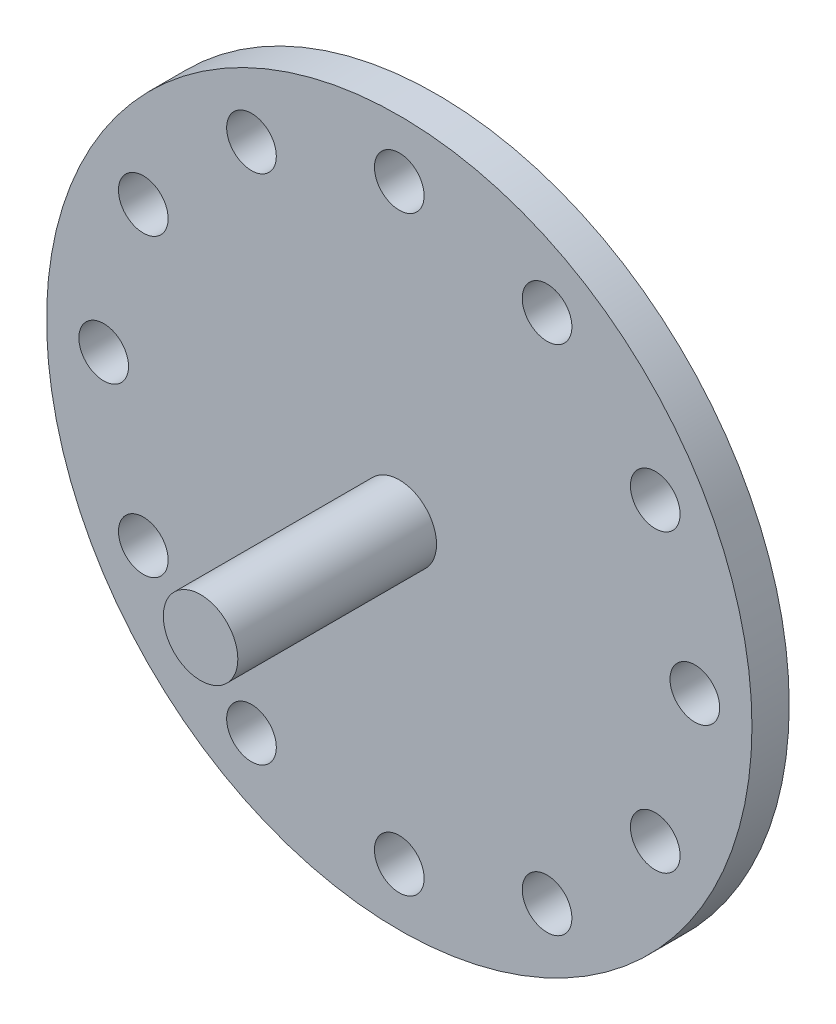
ISO-10303-21;
HEADER;
FILE_DESCRIPTION(('STEP AP214'),'2;1');
FILE_NAME('part.step','',(''),(''),'','','');
FILE_SCHEMA(('AUTOMOTIVE_DESIGN { 1 0 10303 214 1 1 1 1 }'));
ENDSEC;
DATA;
#1=APPLICATION_CONTEXT('core data for automotive mechanical design processes');
#2=APPLICATION_PROTOCOL_DEFINITION('international standard','automotive_design',2000,#1);
#3=PRODUCT_CONTEXT('',#1,'mechanical');
#4=PRODUCT('Part','Part','',(#3));
#5=PRODUCT_RELATED_PRODUCT_CATEGORY('part','',(#4));
#6=PRODUCT_DEFINITION_FORMATION('','',#4);
#7=PRODUCT_DEFINITION_CONTEXT('part definition',#1,'design');
#8=PRODUCT_DEFINITION('design','',#6,#7);
#9=PRODUCT_DEFINITION_SHAPE('','',#8);
#10=(LENGTH_UNIT() NAMED_UNIT(*) SI_UNIT(.MILLI.,.METRE.));
#11=(NAMED_UNIT(*) PLANE_ANGLE_UNIT() SI_UNIT($,.RADIAN.));
#12=(NAMED_UNIT(*) SI_UNIT($,.STERADIAN.) SOLID_ANGLE_UNIT());
#13=UNCERTAINTY_MEASURE_WITH_UNIT(LENGTH_MEASURE(1.E-05),#10,'distance_accuracy_value','');
#14=(GEOMETRIC_REPRESENTATION_CONTEXT(3) GLOBAL_UNCERTAINTY_ASSIGNED_CONTEXT((#13)) GLOBAL_UNIT_ASSIGNED_CONTEXT((#10,
#11,#12)) REPRESENTATION_CONTEXT('',''));
#15=CARTESIAN_POINT('',(0.,0.,0.));
#16=DIRECTION('',(0.,0.,1.));
#17=DIRECTION('',(1.,0.,0.));
#18=AXIS2_PLACEMENT_3D('',#15,#16,#17);
#19=CARTESIAN_POINT('',(0.,0.,3.));
#20=DIRECTION('',(0.,0.,1.));
#21=DIRECTION('',(1.,0.,0.));
#22=AXIS2_PLACEMENT_3D('',#19,#20,#21);
#23=PLANE('',#22);
#24=CARTESIAN_POINT('',(0.,0.,3.));
#25=DIRECTION('',(0.,0.,1.));
#26=DIRECTION('',(1.,0.,0.));
#27=AXIS2_PLACEMENT_3D('',#24,#25,#26);
#28=CIRCLE('',#27,3.);
#29=CARTESIAN_POINT('',(3.,0.,3.));
#30=VERTEX_POINT('',#29);
#31=EDGE_CURVE('E148',#30,#30,#28,.T.);
#32=ORIENTED_EDGE('',*,*,#31,.F.);
#33=EDGE_LOOP('',(#32));
#34=FACE_BOUND('',#33,.T.);
#35=CARTESIAN_POINT('',(11.9000000000002,20.6114046100695,3.));
#36=DIRECTION('',(0.,0.,1.));
#37=DIRECTION('',(1.,0.,0.));
#38=AXIS2_PLACEMENT_3D('',#35,#36,#37);
#39=CIRCLE('',#38,2.);
#40=CARTESIAN_POINT('',(13.9000000000002,20.6114046100695,3.));
#41=VERTEX_POINT('',#40);
#42=EDGE_CURVE('E128',#41,#41,#39,.T.);
#43=ORIENTED_EDGE('',*,*,#42,.F.);
#44=EDGE_LOOP('',(#43));
#45=FACE_BOUND('',#44,.T.);
#46=CARTESIAN_POINT('',(-11.8999999999998,20.6114046100698,3.));
#47=DIRECTION('',(0.,0.,1.));
#48=DIRECTION('',(1.,0.,0.));
#49=AXIS2_PLACEMENT_3D('',#46,#47,#48);
#50=CIRCLE('',#49,2.);
#51=CARTESIAN_POINT('',(-9.8999999999998,20.6114046100698,3.));
#52=VERTEX_POINT('',#51);
#53=EDGE_CURVE('E112',#52,#52,#50,.T.);
#54=ORIENTED_EDGE('',*,*,#53,.F.);
#55=EDGE_LOOP('',(#54));
#56=FACE_BOUND('',#55,.T.);
#57=CARTESIAN_POINT('',(-23.8,1.66194511728933E-13,3.));
#58=DIRECTION('',(0.,0.,1.));
#59=DIRECTION('',(1.,0.,0.));
#60=AXIS2_PLACEMENT_3D('',#57,#58,#59);
#61=CIRCLE('',#60,2.);
#62=CARTESIAN_POINT('',(-21.8,1.66194511728933E-13,3.));
#63=VERTEX_POINT('',#62);
#64=EDGE_CURVE('E96',#63,#63,#61,.T.);
#65=ORIENTED_EDGE('',*,*,#64,.F.);
#66=EDGE_LOOP('',(#65));
#67=FACE_BOUND('',#66,.T.);
#68=CARTESIAN_POINT('',(-11.9000000000001,-20.6114046100696,3.));
#69=DIRECTION('',(0.,0.,1.));
#70=DIRECTION('',(1.,0.,0.));
#71=AXIS2_PLACEMENT_3D('',#68,#69,#70);
#72=CIRCLE('',#71,2.00000000000001);
#73=CARTESIAN_POINT('',(-9.90000000000009,-20.6114046100696,3.));
#74=VERTEX_POINT('',#73);
#75=EDGE_CURVE('E80',#74,#74,#72,.T.);
#76=ORIENTED_EDGE('',*,*,#75,.F.);
#77=EDGE_LOOP('',(#76));
#78=FACE_BOUND('',#77,.T.);
#79=CARTESIAN_POINT('',(11.9,-20.6114046100697,3.));
#80=DIRECTION('',(0.,0.,1.));
#81=DIRECTION('',(1.,0.,0.));
#82=AXIS2_PLACEMENT_3D('',#79,#80,#81);
#83=CIRCLE('',#82,2.);
#84=CARTESIAN_POINT('',(13.9,-20.6114046100697,3.));
#85=VERTEX_POINT('',#84);
#86=EDGE_CURVE('E64',#85,#85,#83,.T.);
#87=ORIENTED_EDGE('',*,*,#86,.F.);
#88=EDGE_LOOP('',(#87));
#89=FACE_BOUND('',#88,.T.);
#90=CARTESIAN_POINT('',(23.8,0.,3.));
#91=DIRECTION('',(0.,0.,1.));
#92=DIRECTION('',(1.,0.,0.));
#93=AXIS2_PLACEMENT_3D('',#90,#91,#92);
#94=CIRCLE('',#93,2.);
#95=CARTESIAN_POINT('',(25.8,0.,3.));
#96=VERTEX_POINT('',#95);
#97=EDGE_CURVE('E50',#96,#96,#94,.T.);
#98=ORIENTED_EDGE('',*,*,#97,.F.);
#99=EDGE_LOOP('',(#98));
#100=FACE_BOUND('',#99,.T.);
#101=CARTESIAN_POINT('',(0.,0.,3.));
#102=DIRECTION('',(0.,0.,1.));
#103=DIRECTION('',(1.,0.,0.));
#104=AXIS2_PLACEMENT_3D('',#101,#102,#103);
#105=CIRCLE('',#104,28.4);
#106=CARTESIAN_POINT('',(28.4,0.,3.));
#107=VERTEX_POINT('',#106);
#108=EDGE_CURVE('E10',#107,#107,#105,.T.);
#109=ORIENTED_EDGE('',*,*,#108,.T.);
#110=EDGE_LOOP('',(#109));
#111=FACE_BOUND('',#110,.T.);
#112=CARTESIAN_POINT('',(20.6114046100696,-11.9,3.));
#113=DIRECTION('',(0.,0.,1.));
#114=DIRECTION('',(1.,0.,0.));
#115=AXIS2_PLACEMENT_3D('',#112,#113,#114);
#116=CIRCLE('',#115,2.);
#117=CARTESIAN_POINT('',(22.6114046100696,-11.9,3.));
#118=VERTEX_POINT('',#117);
#119=EDGE_CURVE('E56',#118,#118,#116,.T.);
#120=ORIENTED_EDGE('',*,*,#119,.F.);
#121=EDGE_LOOP('',(#120));
#122=FACE_BOUND('',#121,.T.);
#123=CARTESIAN_POINT('',(0.,-23.8,3.));
#124=DIRECTION('',(0.,0.,1.));
#125=DIRECTION('',(1.,0.,0.));
#126=AXIS2_PLACEMENT_3D('',#123,#124,#125);
#127=CIRCLE('',#126,2.);
#128=CARTESIAN_POINT('',(1.99999999999992,-23.8,3.));
#129=VERTEX_POINT('',#128);
#130=EDGE_CURVE('E72',#129,#129,#127,.T.);
#131=ORIENTED_EDGE('',*,*,#130,.F.);
#132=EDGE_LOOP('',(#131));
#133=FACE_BOUND('',#132,.T.);
#134=CARTESIAN_POINT('',(-20.6114046100697,-11.8999999999999,3.));
#135=DIRECTION('',(0.,0.,1.));
#136=DIRECTION('',(1.,0.,0.));
#137=AXIS2_PLACEMENT_3D('',#134,#135,#136);
#138=CIRCLE('',#137,2.);
#139=CARTESIAN_POINT('',(-18.6114046100697,-11.8999999999999,3.));
#140=VERTEX_POINT('',#139);
#141=EDGE_CURVE('E88',#140,#140,#138,.T.);
#142=ORIENTED_EDGE('',*,*,#141,.F.);
#143=EDGE_LOOP('',(#142));
#144=FACE_BOUND('',#143,.T.);
#145=CARTESIAN_POINT('',(-20.6114046100695,11.9000000000002,3.));
#146=DIRECTION('',(0.,0.,1.));
#147=DIRECTION('',(1.,0.,0.));
#148=AXIS2_PLACEMENT_3D('',#145,#146,#147);
#149=CIRCLE('',#148,2.);
#150=CARTESIAN_POINT('',(-18.6114046100695,11.9000000000002,3.));
#151=VERTEX_POINT('',#150);
#152=EDGE_CURVE('E104',#151,#151,#149,.T.);
#153=ORIENTED_EDGE('',*,*,#152,.F.);
#154=EDGE_LOOP('',(#153));
#155=FACE_BOUND('',#154,.T.);
#156=CARTESIAN_POINT('',(2.492917675934E-13,23.8,3.));
#157=DIRECTION('',(0.,0.,1.));
#158=DIRECTION('',(1.,0.,0.));
#159=AXIS2_PLACEMENT_3D('',#156,#157,#158);
#160=CIRCLE('',#159,2.);
#161=CARTESIAN_POINT('',(2.00000000000025,23.8,3.));
#162=VERTEX_POINT('',#161);
#163=EDGE_CURVE('E120',#162,#162,#160,.T.);
#164=ORIENTED_EDGE('',*,*,#163,.F.);
#165=EDGE_LOOP('',(#164));
#166=FACE_BOUND('',#165,.T.);
#167=CARTESIAN_POINT('',(20.6114046100698,11.8999999999997,3.));
#168=DIRECTION('',(0.,0.,1.));
#169=DIRECTION('',(1.,0.,0.));
#170=AXIS2_PLACEMENT_3D('',#167,#168,#169);
#171=CIRCLE('',#170,2.);
#172=CARTESIAN_POINT('',(22.6114046100698,11.8999999999997,3.));
#173=VERTEX_POINT('',#172);
#174=EDGE_CURVE('E136',#173,#173,#171,.T.);
#175=ORIENTED_EDGE('',*,*,#174,.F.);
#176=EDGE_LOOP('',(#175));
#177=FACE_BOUND('',#176,.T.);
#178=ADVANCED_FACE('F37',(#34,#45,#56,#67,#78,#89,#100,#111,#122,#133,#144,#155,#166,#177),#23,.T.);
#179=CARTESIAN_POINT('',(0.,0.,0.));
#180=DIRECTION('',(0.,0.,1.));
#181=DIRECTION('',(1.,0.,0.));
#182=AXIS2_PLACEMENT_3D('',#179,#180,#181);
#183=PLANE('',#182);
#184=CARTESIAN_POINT('',(0.,0.,0.));
#185=DIRECTION('',(0.,0.,1.));
#186=DIRECTION('',(1.,0.,0.));
#187=AXIS2_PLACEMENT_3D('',#184,#185,#186);
#188=CIRCLE('',#187,28.4);
#189=CARTESIAN_POINT('',(28.4,0.,0.));
#190=VERTEX_POINT('',#189);
#191=EDGE_CURVE('E41',#190,#190,#188,.T.);
#192=ORIENTED_EDGE('',*,*,#191,.F.);
#193=EDGE_LOOP('',(#192));
#194=FACE_BOUND('',#193,.T.);
#195=CARTESIAN_POINT('',(23.8,0.,0.));
#196=DIRECTION('',(0.,0.,1.));
#197=DIRECTION('',(1.,0.,0.));
#198=AXIS2_PLACEMENT_3D('',#195,#196,#197);
#199=CIRCLE('',#198,2.);
#200=CARTESIAN_POINT('',(25.8,0.,0.));
#201=VERTEX_POINT('',#200);
#202=EDGE_CURVE('E52',#201,#201,#199,.T.);
#203=ORIENTED_EDGE('',*,*,#202,.T.);
#204=EDGE_LOOP('',(#203));
#205=FACE_BOUND('',#204,.T.);
#206=CARTESIAN_POINT('',(20.6114046100696,-11.9,0.));
#207=DIRECTION('',(0.,0.,1.));
#208=DIRECTION('',(1.,0.,0.));
#209=AXIS2_PLACEMENT_3D('',#206,#207,#208);
#210=CIRCLE('',#209,2.);
#211=CARTESIAN_POINT('',(22.6114046100696,-11.9,0.));
#212=VERTEX_POINT('',#211);
#213=EDGE_CURVE('E60',#212,#212,#210,.T.);
#214=ORIENTED_EDGE('',*,*,#213,.T.);
#215=EDGE_LOOP('',(#214));
#216=FACE_BOUND('',#215,.T.);
#217=CARTESIAN_POINT('',(11.9,-20.6114046100697,0.));
#218=DIRECTION('',(0.,0.,1.));
#219=DIRECTION('',(1.,0.,0.));
#220=AXIS2_PLACEMENT_3D('',#217,#218,#219);
#221=CIRCLE('',#220,2.);
#222=CARTESIAN_POINT('',(13.9,-20.6114046100697,0.));
#223=VERTEX_POINT('',#222);
#224=EDGE_CURVE('E68',#223,#223,#221,.T.);
#225=ORIENTED_EDGE('',*,*,#224,.T.);
#226=EDGE_LOOP('',(#225));
#227=FACE_BOUND('',#226,.T.);
#228=CARTESIAN_POINT('',(0.,-23.8,0.));
#229=DIRECTION('',(0.,0.,1.));
#230=DIRECTION('',(1.,0.,0.));
#231=AXIS2_PLACEMENT_3D('',#228,#229,#230);
#232=CIRCLE('',#231,2.);
#233=CARTESIAN_POINT('',(1.99999999999992,-23.8,0.));
#234=VERTEX_POINT('',#233);
#235=EDGE_CURVE('E76',#234,#234,#232,.T.);
#236=ORIENTED_EDGE('',*,*,#235,.T.);
#237=EDGE_LOOP('',(#236));
#238=FACE_BOUND('',#237,.T.);
#239=CARTESIAN_POINT('',(-11.9000000000001,-20.6114046100696,0.));
#240=DIRECTION('',(0.,0.,1.));
#241=DIRECTION('',(1.,0.,0.));
#242=AXIS2_PLACEMENT_3D('',#239,#240,#241);
#243=CIRCLE('',#242,2.00000000000001);
#244=CARTESIAN_POINT('',(-9.90000000000009,-20.6114046100696,0.));
#245=VERTEX_POINT('',#244);
#246=EDGE_CURVE('E84',#245,#245,#243,.T.);
#247=ORIENTED_EDGE('',*,*,#246,.T.);
#248=EDGE_LOOP('',(#247));
#249=FACE_BOUND('',#248,.T.);
#250=CARTESIAN_POINT('',(-20.6114046100697,-11.8999999999999,0.));
#251=DIRECTION('',(0.,0.,1.));
#252=DIRECTION('',(1.,0.,0.));
#253=AXIS2_PLACEMENT_3D('',#250,#251,#252);
#254=CIRCLE('',#253,2.);
#255=CARTESIAN_POINT('',(-18.6114046100697,-11.8999999999999,0.));
#256=VERTEX_POINT('',#255);
#257=EDGE_CURVE('E92',#256,#256,#254,.T.);
#258=ORIENTED_EDGE('',*,*,#257,.T.);
#259=EDGE_LOOP('',(#258));
#260=FACE_BOUND('',#259,.T.);
#261=CARTESIAN_POINT('',(-23.8,1.66194511728933E-13,0.));
#262=DIRECTION('',(0.,0.,1.));
#263=DIRECTION('',(1.,0.,0.));
#264=AXIS2_PLACEMENT_3D('',#261,#262,#263);
#265=CIRCLE('',#264,2.);
#266=CARTESIAN_POINT('',(-21.8,1.66194511728933E-13,0.));
#267=VERTEX_POINT('',#266);
#268=EDGE_CURVE('E100',#267,#267,#265,.T.);
#269=ORIENTED_EDGE('',*,*,#268,.T.);
#270=EDGE_LOOP('',(#269));
#271=FACE_BOUND('',#270,.T.);
#272=CARTESIAN_POINT('',(-20.6114046100695,11.9000000000002,0.));
#273=DIRECTION('',(0.,0.,1.));
#274=DIRECTION('',(1.,0.,0.));
#275=AXIS2_PLACEMENT_3D('',#272,#273,#274);
#276=CIRCLE('',#275,2.);
#277=CARTESIAN_POINT('',(-18.6114046100695,11.9000000000002,0.));
#278=VERTEX_POINT('',#277);
#279=EDGE_CURVE('E108',#278,#278,#276,.T.);
#280=ORIENTED_EDGE('',*,*,#279,.T.);
#281=EDGE_LOOP('',(#280));
#282=FACE_BOUND('',#281,.T.);
#283=CARTESIAN_POINT('',(-11.8999999999998,20.6114046100698,0.));
#284=DIRECTION('',(0.,0.,1.));
#285=DIRECTION('',(1.,0.,0.));
#286=AXIS2_PLACEMENT_3D('',#283,#284,#285);
#287=CIRCLE('',#286,2.);
#288=CARTESIAN_POINT('',(-9.8999999999998,20.6114046100698,0.));
#289=VERTEX_POINT('',#288);
#290=EDGE_CURVE('E116',#289,#289,#287,.T.);
#291=ORIENTED_EDGE('',*,*,#290,.T.);
#292=EDGE_LOOP('',(#291));
#293=FACE_BOUND('',#292,.T.);
#294=CARTESIAN_POINT('',(2.492917675934E-13,23.8,0.));
#295=DIRECTION('',(0.,0.,1.));
#296=DIRECTION('',(1.,0.,0.));
#297=AXIS2_PLACEMENT_3D('',#294,#295,#296);
#298=CIRCLE('',#297,2.);
#299=CARTESIAN_POINT('',(2.00000000000025,23.8,0.));
#300=VERTEX_POINT('',#299);
#301=EDGE_CURVE('E124',#300,#300,#298,.T.);
#302=ORIENTED_EDGE('',*,*,#301,.T.);
#303=EDGE_LOOP('',(#302));
#304=FACE_BOUND('',#303,.T.);
#305=CARTESIAN_POINT('',(11.9000000000002,20.6114046100695,0.));
#306=DIRECTION('',(0.,0.,1.));
#307=DIRECTION('',(1.,0.,0.));
#308=AXIS2_PLACEMENT_3D('',#305,#306,#307);
#309=CIRCLE('',#308,2.);
#310=CARTESIAN_POINT('',(13.9000000000002,20.6114046100695,0.));
#311=VERTEX_POINT('',#310);
#312=EDGE_CURVE('E132',#311,#311,#309,.T.);
#313=ORIENTED_EDGE('',*,*,#312,.T.);
#314=EDGE_LOOP('',(#313));
#315=FACE_BOUND('',#314,.T.);
#316=CARTESIAN_POINT('',(20.6114046100698,11.8999999999997,0.));
#317=DIRECTION('',(0.,0.,1.));
#318=DIRECTION('',(1.,0.,0.));
#319=AXIS2_PLACEMENT_3D('',#316,#317,#318);
#320=CIRCLE('',#319,2.);
#321=CARTESIAN_POINT('',(22.6114046100698,11.8999999999997,0.));
#322=VERTEX_POINT('',#321);
#323=EDGE_CURVE('E140',#322,#322,#320,.T.);
#324=ORIENTED_EDGE('',*,*,#323,.T.);
#325=EDGE_LOOP('',(#324));
#326=FACE_BOUND('',#325,.T.);
#327=ADVANCED_FACE('F167',(#194,#205,#216,#227,#238,#249,#260,#271,#282,#293,#304,#315,#326),
#183,.F.);
#328=CARTESIAN_POINT('',(0.,0.,3.));
#329=DIRECTION('',(0.,0.,-1.));
#330=DIRECTION('',(-1.,0.,0.));
#331=AXIS2_PLACEMENT_3D('',#328,#329,#330);
#332=CYLINDRICAL_SURFACE('',#331,28.4);
#333=ORIENTED_EDGE('',*,*,#108,.F.);
#334=EDGE_LOOP('',(#333));
#335=FACE_BOUND('',#334,.T.);
#336=ORIENTED_EDGE('',*,*,#191,.T.);
#337=EDGE_LOOP('',(#336));
#338=FACE_BOUND('',#337,.T.);
#339=ADVANCED_FACE('F39',(#335,#338),#332,.T.);
#340=CARTESIAN_POINT('',(23.8,0.,3.));
#341=DIRECTION('',(0.,0.,-1.));
#342=DIRECTION('',(-1.,0.,0.));
#343=AXIS2_PLACEMENT_3D('',#340,#341,#342);
#344=CYLINDRICAL_SURFACE('',#343,2.);
#345=ORIENTED_EDGE('',*,*,#97,.T.);
#346=EDGE_LOOP('',(#345));
#347=FACE_BOUND('',#346,.T.);
#348=ORIENTED_EDGE('',*,*,#202,.F.);
#349=EDGE_LOOP('',(#348));
#350=FACE_BOUND('',#349,.T.);
#351=ADVANCED_FACE('F204',(#347,#350),#344,.F.);
#352=CARTESIAN_POINT('',(20.6114046100696,-11.9,3.));
#353=DIRECTION('',(0.,0.,-1.));
#354=DIRECTION('',(-1.,0.,0.));
#355=AXIS2_PLACEMENT_3D('',#352,#353,#354);
#356=CYLINDRICAL_SURFACE('',#355,2.);
#357=ORIENTED_EDGE('',*,*,#119,.T.);
#358=EDGE_LOOP('',(#357));
#359=FACE_BOUND('',#358,.T.);
#360=ORIENTED_EDGE('',*,*,#213,.F.);
#361=EDGE_LOOP('',(#360));
#362=FACE_BOUND('',#361,.T.);
#363=ADVANCED_FACE('F211',(#359,#362),#356,.F.);
#364=CARTESIAN_POINT('',(11.9,-20.6114046100697,3.));
#365=DIRECTION('',(0.,0.,-1.));
#366=DIRECTION('',(-1.,0.,0.));
#367=AXIS2_PLACEMENT_3D('',#364,#365,#366);
#368=CYLINDRICAL_SURFACE('',#367,2.);
#369=ORIENTED_EDGE('',*,*,#86,.T.);
#370=EDGE_LOOP('',(#369));
#371=FACE_BOUND('',#370,.T.);
#372=ORIENTED_EDGE('',*,*,#224,.F.);
#373=EDGE_LOOP('',(#372));
#374=FACE_BOUND('',#373,.T.);
#375=ADVANCED_FACE('F215',(#371,#374),#368,.F.);
#376=CARTESIAN_POINT('',(0.,-23.8,3.));
#377=DIRECTION('',(0.,0.,-1.));
#378=DIRECTION('',(-1.,0.,0.));
#379=AXIS2_PLACEMENT_3D('',#376,#377,#378);
#380=CYLINDRICAL_SURFACE('',#379,2.);
#381=ORIENTED_EDGE('',*,*,#130,.T.);
#382=EDGE_LOOP('',(#381));
#383=FACE_BOUND('',#382,.T.);
#384=ORIENTED_EDGE('',*,*,#235,.F.);
#385=EDGE_LOOP('',(#384));
#386=FACE_BOUND('',#385,.T.);
#387=ADVANCED_FACE('F219',(#383,#386),#380,.F.);
#388=CARTESIAN_POINT('',(-11.9000000000001,-20.6114046100696,3.));
#389=DIRECTION('',(0.,0.,-1.));
#390=DIRECTION('',(-1.,0.,0.));
#391=AXIS2_PLACEMENT_3D('',#388,#389,#390);
#392=CYLINDRICAL_SURFACE('',#391,2.00000000000001);
#393=ORIENTED_EDGE('',*,*,#75,.T.);
#394=EDGE_LOOP('',(#393));
#395=FACE_BOUND('',#394,.T.);
#396=ORIENTED_EDGE('',*,*,#246,.F.);
#397=EDGE_LOOP('',(#396));
#398=FACE_BOUND('',#397,.T.);
#399=ADVANCED_FACE('F223',(#395,#398),#392,.F.);
#400=CARTESIAN_POINT('',(-20.6114046100697,-11.8999999999999,3.));
#401=DIRECTION('',(0.,0.,-1.));
#402=DIRECTION('',(-1.,0.,0.));
#403=AXIS2_PLACEMENT_3D('',#400,#401,#402);
#404=CYLINDRICAL_SURFACE('',#403,2.);
#405=ORIENTED_EDGE('',*,*,#141,.T.);
#406=EDGE_LOOP('',(#405));
#407=FACE_BOUND('',#406,.T.);
#408=ORIENTED_EDGE('',*,*,#257,.F.);
#409=EDGE_LOOP('',(#408));
#410=FACE_BOUND('',#409,.T.);
#411=ADVANCED_FACE('F227',(#407,#410),#404,.F.);
#412=CARTESIAN_POINT('',(-23.8,1.66194511728933E-13,3.));
#413=DIRECTION('',(0.,0.,-1.));
#414=DIRECTION('',(-1.,0.,0.));
#415=AXIS2_PLACEMENT_3D('',#412,#413,#414);
#416=CYLINDRICAL_SURFACE('',#415,2.);
#417=ORIENTED_EDGE('',*,*,#64,.T.);
#418=EDGE_LOOP('',(#417));
#419=FACE_BOUND('',#418,.T.);
#420=ORIENTED_EDGE('',*,*,#268,.F.);
#421=EDGE_LOOP('',(#420));
#422=FACE_BOUND('',#421,.T.);
#423=ADVANCED_FACE('F231',(#419,#422),#416,.F.);
#424=CARTESIAN_POINT('',(-20.6114046100695,11.9000000000002,3.));
#425=DIRECTION('',(0.,0.,-1.));
#426=DIRECTION('',(-1.,0.,0.));
#427=AXIS2_PLACEMENT_3D('',#424,#425,#426);
#428=CYLINDRICAL_SURFACE('',#427,2.);
#429=ORIENTED_EDGE('',*,*,#152,.T.);
#430=EDGE_LOOP('',(#429));
#431=FACE_BOUND('',#430,.T.);
#432=ORIENTED_EDGE('',*,*,#279,.F.);
#433=EDGE_LOOP('',(#432));
#434=FACE_BOUND('',#433,.T.);
#435=ADVANCED_FACE('F235',(#431,#434),#428,.F.);
#436=CARTESIAN_POINT('',(-11.8999999999998,20.6114046100698,3.));
#437=DIRECTION('',(0.,0.,-1.));
#438=DIRECTION('',(-1.,0.,0.));
#439=AXIS2_PLACEMENT_3D('',#436,#437,#438);
#440=CYLINDRICAL_SURFACE('',#439,2.);
#441=ORIENTED_EDGE('',*,*,#53,.T.);
#442=EDGE_LOOP('',(#441));
#443=FACE_BOUND('',#442,.T.);
#444=ORIENTED_EDGE('',*,*,#290,.F.);
#445=EDGE_LOOP('',(#444));
#446=FACE_BOUND('',#445,.T.);
#447=ADVANCED_FACE('F239',(#443,#446),#440,.F.);
#448=CARTESIAN_POINT('',(2.492917675934E-13,23.8,3.));
#449=DIRECTION('',(0.,0.,-1.));
#450=DIRECTION('',(-1.,0.,0.));
#451=AXIS2_PLACEMENT_3D('',#448,#449,#450);
#452=CYLINDRICAL_SURFACE('',#451,2.);
#453=ORIENTED_EDGE('',*,*,#163,.T.);
#454=EDGE_LOOP('',(#453));
#455=FACE_BOUND('',#454,.T.);
#456=ORIENTED_EDGE('',*,*,#301,.F.);
#457=EDGE_LOOP('',(#456));
#458=FACE_BOUND('',#457,.T.);
#459=ADVANCED_FACE('F243',(#455,#458),#452,.F.);
#460=CARTESIAN_POINT('',(11.9000000000002,20.6114046100695,3.));
#461=DIRECTION('',(0.,0.,-1.));
#462=DIRECTION('',(-1.,0.,0.));
#463=AXIS2_PLACEMENT_3D('',#460,#461,#462);
#464=CYLINDRICAL_SURFACE('',#463,2.);
#465=ORIENTED_EDGE('',*,*,#42,.T.);
#466=EDGE_LOOP('',(#465));
#467=FACE_BOUND('',#466,.T.);
#468=ORIENTED_EDGE('',*,*,#312,.F.);
#469=EDGE_LOOP('',(#468));
#470=FACE_BOUND('',#469,.T.);
#471=ADVANCED_FACE('F195',(#467,#470),#464,.F.);
#472=CARTESIAN_POINT('',(20.6114046100698,11.8999999999997,3.));
#473=DIRECTION('',(0.,0.,-1.));
#474=DIRECTION('',(-1.,0.,0.));
#475=AXIS2_PLACEMENT_3D('',#472,#473,#474);
#476=CYLINDRICAL_SURFACE('',#475,2.);
#477=ORIENTED_EDGE('',*,*,#174,.T.);
#478=EDGE_LOOP('',(#477));
#479=FACE_BOUND('',#478,.T.);
#480=ORIENTED_EDGE('',*,*,#323,.F.);
#481=EDGE_LOOP('',(#480));
#482=FACE_BOUND('',#481,.T.);
#483=ADVANCED_FACE('F161',(#479,#482),#476,.F.);
#484=CARTESIAN_POINT('',(0.,0.,19.));
#485=DIRECTION('',(0.,0.,-1.));
#486=DIRECTION('',(-1.,0.,0.));
#487=AXIS2_PLACEMENT_3D('',#484,#485,#486);
#488=CYLINDRICAL_SURFACE('',#487,3.);
#489=CARTESIAN_POINT('',(0.,0.,19.));
#490=DIRECTION('',(0.,0.,1.));
#491=DIRECTION('',(1.,0.,0.));
#492=AXIS2_PLACEMENT_3D('',#489,#490,#491);
#493=CIRCLE('',#492,3.);
#494=CARTESIAN_POINT('',(3.,0.,19.));
#495=VERTEX_POINT('',#494);
#496=EDGE_CURVE('E144',#495,#495,#493,.T.);
#497=ORIENTED_EDGE('',*,*,#496,.F.);
#498=EDGE_LOOP('',(#497));
#499=FACE_BOUND('',#498,.T.);
#500=ORIENTED_EDGE('',*,*,#31,.T.);
#501=EDGE_LOOP('',(#500));
#502=FACE_BOUND('',#501,.T.);
#503=ADVANCED_FACE('F158',(#499,#502),#488,.T.);
#504=CARTESIAN_POINT('',(0.,0.,19.));
#505=DIRECTION('',(0.,0.,1.));
#506=DIRECTION('',(1.,0.,0.));
#507=AXIS2_PLACEMENT_3D('',#504,#505,#506);
#508=PLANE('',#507);
#509=ORIENTED_EDGE('',*,*,#496,.T.);
#510=EDGE_LOOP('',(#509));
#511=FACE_BOUND('',#510,.T.);
#512=ADVANCED_FACE('F156',(#511),#508,.T.);
#513=CLOSED_SHELL('',(#178,#327,#339,#351,#363,#375,#387,#399,#411,#423,#435,#447,#459,#471,
#483,#503,#512));
#514=MANIFOLD_SOLID_BREP('B2',#513);
#515=ADVANCED_BREP_SHAPE_REPRESENTATION('',(#18,#514),#14);
#516=SHAPE_DEFINITION_REPRESENTATION(#9,#515);
ENDSEC;
END-ISO-10303-21;
